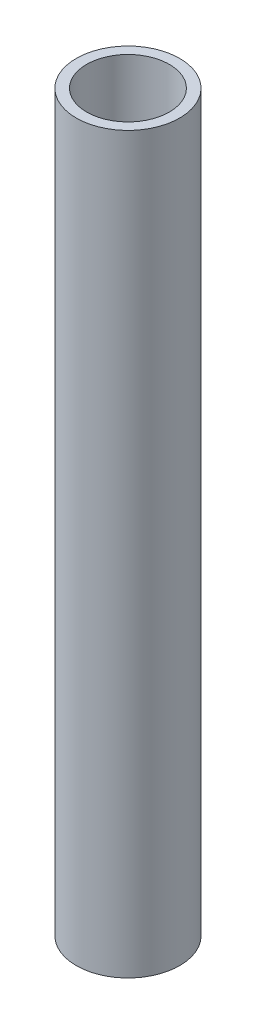
ISO-10303-21;
HEADER;
FILE_DESCRIPTION(('STEP AP214'),'2;1');
FILE_NAME('part.step','',(''),(''),'','','');
FILE_SCHEMA(('AUTOMOTIVE_DESIGN { 1 0 10303 214 1 1 1 1 }'));
ENDSEC;
DATA;
#1=APPLICATION_CONTEXT('core data for automotive mechanical design processes');
#2=APPLICATION_PROTOCOL_DEFINITION('international standard','automotive_design',2000,#1);
#3=PRODUCT_CONTEXT('',#1,'mechanical');
#4=PRODUCT('Part','Part','',(#3));
#5=PRODUCT_RELATED_PRODUCT_CATEGORY('part','',(#4));
#6=PRODUCT_DEFINITION_FORMATION('','',#4);
#7=PRODUCT_DEFINITION_CONTEXT('part definition',#1,'design');
#8=PRODUCT_DEFINITION('design','',#6,#7);
#9=PRODUCT_DEFINITION_SHAPE('','',#8);
#10=(LENGTH_UNIT() NAMED_UNIT(*) SI_UNIT(.MILLI.,.METRE.));
#11=(NAMED_UNIT(*) PLANE_ANGLE_UNIT() SI_UNIT($,.RADIAN.));
#12=(NAMED_UNIT(*) SI_UNIT($,.STERADIAN.) SOLID_ANGLE_UNIT());
#13=UNCERTAINTY_MEASURE_WITH_UNIT(LENGTH_MEASURE(1.E-05),#10,'distance_accuracy_value','');
#14=(GEOMETRIC_REPRESENTATION_CONTEXT(3) GLOBAL_UNCERTAINTY_ASSIGNED_CONTEXT((#13)) GLOBAL_UNIT_ASSIGNED_CONTEXT((#10,
#11,#12)) REPRESENTATION_CONTEXT('',''));
#15=CARTESIAN_POINT('',(0.,0.,0.));
#16=DIRECTION('',(0.,0.,1.));
#17=DIRECTION('',(1.,0.,0.));
#18=AXIS2_PLACEMENT_3D('',#15,#16,#17);
#19=CARTESIAN_POINT('',(0.,71.,0.));
#20=DIRECTION('',(0.,1.,0.));
#21=DIRECTION('',(0.,0.,1.));
#22=AXIS2_PLACEMENT_3D('',#19,#20,#21);
#23=PLANE('',#22);
#24=CARTESIAN_POINT('',(0.,71.,0.));
#25=DIRECTION('',(0.,1.,0.));
#26=DIRECTION('',(0.,0.,1.));
#27=AXIS2_PLACEMENT_3D('',#24,#25,#26);
#28=CIRCLE('',#27,5.);
#29=CARTESIAN_POINT('',(0.,71.,5.));
#30=VERTEX_POINT('',#29);
#31=EDGE_CURVE('E10',#30,#30,#28,.T.);
#32=ORIENTED_EDGE('',*,*,#31,.T.);
#33=EDGE_LOOP('',(#32));
#34=FACE_BOUND('',#33,.T.);
#35=CARTESIAN_POINT('',(0.,71.,0.));
#36=DIRECTION('',(0.,1.,0.));
#37=DIRECTION('',(0.,0.,1.));
#38=AXIS2_PLACEMENT_3D('',#35,#36,#37);
#39=CIRCLE('',#38,4.);
#40=CARTESIAN_POINT('',(0.,71.,4.));
#41=VERTEX_POINT('',#40);
#42=EDGE_CURVE('E46',#41,#41,#39,.T.);
#43=ORIENTED_EDGE('',*,*,#42,.F.);
#44=EDGE_LOOP('',(#43));
#45=FACE_BOUND('',#44,.T.);
#46=ADVANCED_FACE('F35',(#34,#45),#23,.T.);
#47=CARTESIAN_POINT('',(0.,0.,0.));
#48=DIRECTION('',(0.,1.,0.));
#49=DIRECTION('',(0.,0.,1.));
#50=AXIS2_PLACEMENT_3D('',#47,#48,#49);
#51=PLANE('',#50);
#52=CARTESIAN_POINT('',(0.,0.,0.));
#53=DIRECTION('',(0.,1.,0.));
#54=DIRECTION('',(0.,0.,1.));
#55=AXIS2_PLACEMENT_3D('',#52,#53,#54);
#56=CIRCLE('',#55,5.);
#57=CARTESIAN_POINT('',(0.,0.,5.));
#58=VERTEX_POINT('',#57);
#59=EDGE_CURVE('E39',#58,#58,#56,.T.);
#60=ORIENTED_EDGE('',*,*,#59,.F.);
#61=EDGE_LOOP('',(#60));
#62=FACE_BOUND('',#61,.T.);
#63=CARTESIAN_POINT('',(0.,0.,0.));
#64=DIRECTION('',(0.,1.,0.));
#65=DIRECTION('',(0.,0.,1.));
#66=AXIS2_PLACEMENT_3D('',#63,#64,#65);
#67=CIRCLE('',#66,4.);
#68=CARTESIAN_POINT('',(0.,0.,4.));
#69=VERTEX_POINT('',#68);
#70=EDGE_CURVE('E48',#69,#69,#67,.T.);
#71=ORIENTED_EDGE('',*,*,#70,.T.);
#72=EDGE_LOOP('',(#71));
#73=FACE_BOUND('',#72,.T.);
#74=ADVANCED_FACE('F58',(#62,#73),#51,.F.);
#75=CARTESIAN_POINT('',(0.,71.,0.));
#76=DIRECTION('',(0.,-1.,0.));
#77=DIRECTION('',(0.,0.,-1.));
#78=AXIS2_PLACEMENT_3D('',#75,#76,#77);
#79=CYLINDRICAL_SURFACE('',#78,5.);
#80=ORIENTED_EDGE('',*,*,#31,.F.);
#81=EDGE_LOOP('',(#80));
#82=FACE_BOUND('',#81,.T.);
#83=ORIENTED_EDGE('',*,*,#59,.T.);
#84=EDGE_LOOP('',(#83));
#85=FACE_BOUND('',#84,.T.);
#86=ADVANCED_FACE('F37',(#82,#85),#79,.T.);
#87=CARTESIAN_POINT('',(0.,71.,0.));
#88=DIRECTION('',(0.,-1.,0.));
#89=DIRECTION('',(0.,0.,-1.));
#90=AXIS2_PLACEMENT_3D('',#87,#88,#89);
#91=CYLINDRICAL_SURFACE('',#90,4.);
#92=ORIENTED_EDGE('',*,*,#42,.T.);
#93=EDGE_LOOP('',(#92));
#94=FACE_BOUND('',#93,.T.);
#95=ORIENTED_EDGE('',*,*,#70,.F.);
#96=EDGE_LOOP('',(#95));
#97=FACE_BOUND('',#96,.T.);
#98=ADVANCED_FACE('F54',(#94,#97),#91,.F.);
#99=CLOSED_SHELL('',(#46,#74,#86,#98));
#100=MANIFOLD_SOLID_BREP('B2',#99);
#101=ADVANCED_BREP_SHAPE_REPRESENTATION('',(#18,#100),#14);
#102=SHAPE_DEFINITION_REPRESENTATION(#9,#101);
ENDSEC;
END-ISO-10303-21;
